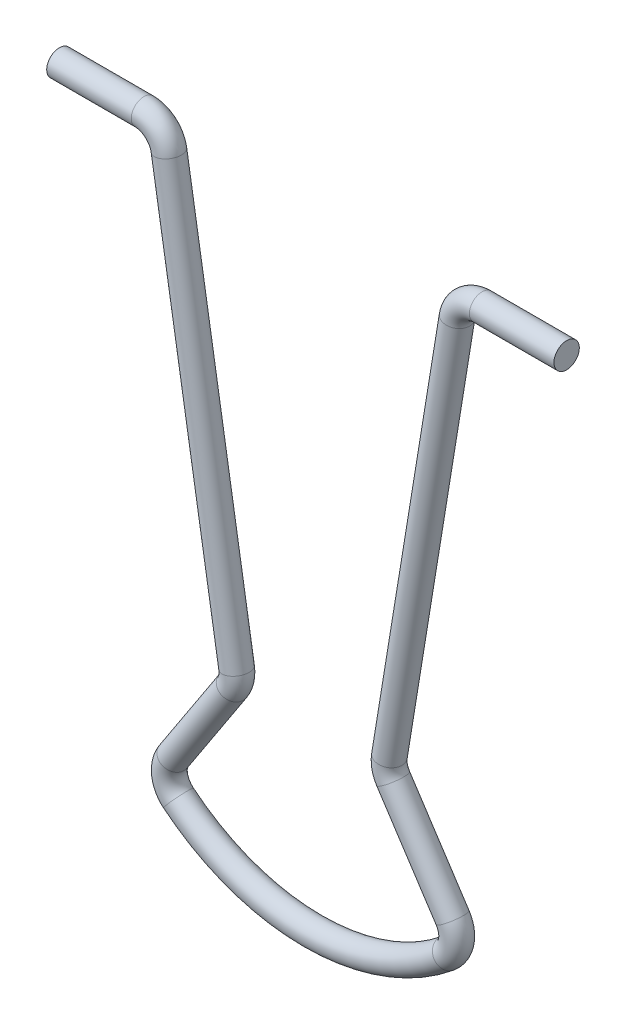
ISO-10303-21;
HEADER;
FILE_DESCRIPTION(('STEP AP214'),'2;1');
FILE_NAME('part.step','',(''),(''),'','','');
FILE_SCHEMA(('AUTOMOTIVE_DESIGN { 1 0 10303 214 1 1 1 1 }'));
ENDSEC;
DATA;
#1=APPLICATION_CONTEXT('core data for automotive mechanical design processes');
#2=APPLICATION_PROTOCOL_DEFINITION('international standard','automotive_design',2000,#1);
#3=PRODUCT_CONTEXT('',#1,'mechanical');
#4=PRODUCT('Part','Part','',(#3));
#5=PRODUCT_RELATED_PRODUCT_CATEGORY('part','',(#4));
#6=PRODUCT_DEFINITION_FORMATION('','',#4);
#7=PRODUCT_DEFINITION_CONTEXT('part definition',#1,'design');
#8=PRODUCT_DEFINITION('design','',#6,#7);
#9=PRODUCT_DEFINITION_SHAPE('','',#8);
#10=(LENGTH_UNIT() NAMED_UNIT(*) SI_UNIT(.MILLI.,.METRE.));
#11=(NAMED_UNIT(*) PLANE_ANGLE_UNIT() SI_UNIT($,.RADIAN.));
#12=(NAMED_UNIT(*) SI_UNIT($,.STERADIAN.) SOLID_ANGLE_UNIT());
#13=UNCERTAINTY_MEASURE_WITH_UNIT(LENGTH_MEASURE(1.E-05),#10,'distance_accuracy_value','');
#14=(GEOMETRIC_REPRESENTATION_CONTEXT(3) GLOBAL_UNCERTAINTY_ASSIGNED_CONTEXT((#13)) GLOBAL_UNIT_ASSIGNED_CONTEXT((#10,
#11,#12)) REPRESENTATION_CONTEXT('',''));
#15=CARTESIAN_POINT('',(0.,0.,0.));
#16=DIRECTION('',(0.,0.,1.));
#17=DIRECTION('',(1.,0.,0.));
#18=AXIS2_PLACEMENT_3D('',#15,#16,#17);
#19=CARTESIAN_POINT('',(-10.,37.,0.));
#20=DIRECTION('',(1.,0.,0.));
#21=DIRECTION('',(0.,0.,1.));
#22=AXIS2_PLACEMENT_3D('',#19,#20,#21);
#23=CYLINDRICAL_SURFACE('',#22,0.750000000000001);
#24=CARTESIAN_POINT('',(-15.,37.,0.));
#25=DIRECTION('',(-1.,0.,0.));
#26=DIRECTION('',(0.,1.,0.));
#27=AXIS2_PLACEMENT_3D('',#24,#25,#26);
#28=CIRCLE('',#27,0.750000000000001);
#29=CARTESIAN_POINT('',(-15.,37.75,0.));
#30=VERTEX_POINT('',#29);
#31=EDGE_CURVE('E29',#30,#30,#28,.T.);
#32=ORIENTED_EDGE('',*,*,#31,.F.);
#33=EDGE_LOOP('',(#32));
#34=FACE_BOUND('',#33,.T.);
#35=CARTESIAN_POINT('',(-10.,37.,0.));
#36=DIRECTION('',(-1.,0.,0.));
#37=DIRECTION('',(0.,1.,0.));
#38=AXIS2_PLACEMENT_3D('',#35,#36,#37);
#39=CIRCLE('',#38,0.750000000000001);
#40=CARTESIAN_POINT('',(-10.,37.75,0.));
#41=VERTEX_POINT('',#40);
#42=EDGE_CURVE('E8',#41,#41,#39,.T.);
#43=ORIENTED_EDGE('',*,*,#42,.T.);
#44=EDGE_LOOP('',(#43));
#45=FACE_BOUND('',#44,.T.);
#46=ADVANCED_FACE('F13',(#34,#45),#23,.T.);
#47=CARTESIAN_POINT('',(-10.,35.5,0.));
#48=DIRECTION('',(0.,0.,-1.));
#49=DIRECTION('',(0.,-1.,0.));
#50=AXIS2_PLACEMENT_3D('',#47,#48,#49);
#51=TOROIDAL_SURFACE('',#50,1.5,0.750000000000001);
#52=CARTESIAN_POINT('',(-8.51960067883648,35.7416978483532,0.));
#53=DIRECTION('',(-0.161131898902153,0.986932880775682,0.));
#54=DIRECTION('',(0.,0.,1.));
#55=AXIS2_PLACEMENT_3D('',#52,#53,#54);
#56=CIRCLE('',#55,0.750000000000001);
#57=CARTESIAN_POINT('',(-7.77940101825471,35.8625467725298,0.));
#58=VERTEX_POINT('',#57);
#59=EDGE_CURVE('E21',#58,#58,#56,.T.);
#60=CARTESIAN_POINT('',(-10.,35.5,0.));
#61=DIRECTION('',(0.,0.,-1.));
#62=DIRECTION('',(0.,-1.,0.));
#63=AXIS2_PLACEMENT_3D('',#60,#61,#62);
#64=CIRCLE('',#63,2.25);
#65=EDGE_CURVE('',#41,#58,#64,.T.);
#66=ORIENTED_EDGE('',*,*,#42,.F.);
#67=ORIENTED_EDGE('',*,*,#59,.T.);
#68=ORIENTED_EDGE('',*,*,#65,.T.);
#69=ORIENTED_EDGE('',*,*,#65,.F.);
#70=EDGE_LOOP('',(#66,#68,#67,#69));
#71=FACE_BOUND('',#70,.T.);
#72=ADVANCED_FACE('F80',(#71),#51,.T.);
#73=CARTESIAN_POINT('',(-4.51960067883648,11.2416978483532,0.));
#74=DIRECTION('',(0.161131898902152,-0.986932880775682,0.));
#75=DIRECTION('',(0.,0.,-1.));
#76=AXIS2_PLACEMENT_3D('',#73,#74,#75);
#77=CYLINDRICAL_SURFACE('',#76,0.750000000000001);
#78=ORIENTED_EDGE('',*,*,#59,.F.);
#79=EDGE_LOOP('',(#78));
#80=FACE_BOUND('',#79,.T.);
#81=CARTESIAN_POINT('',(-4.51960067883648,11.2416978483532,0.));
#82=DIRECTION('',(-0.161131898902153,0.986932880775682,0.));
#83=DIRECTION('',(0.,0.,1.));
#84=AXIS2_PLACEMENT_3D('',#81,#82,#83);
#85=CIRCLE('',#84,0.750000000000001);
#86=CARTESIAN_POINT('',(-3.77940101825472,11.3625467725298,0.));
#87=VERTEX_POINT('',#86);
#88=EDGE_CURVE('E26',#87,#87,#85,.T.);
#89=ORIENTED_EDGE('',*,*,#88,.T.);
#90=EDGE_LOOP('',(#89));
#91=FACE_BOUND('',#90,.T.);
#92=ADVANCED_FACE('F86',(#80,#91),#77,.T.);
#93=CARTESIAN_POINT('',(-6.,11.,0.));
#94=DIRECTION('',(0.,0.,-1.));
#95=DIRECTION('',(0.,-1.,0.));
#96=AXIS2_PLACEMENT_3D('',#93,#94,#95);
#97=TOROIDAL_SURFACE('',#96,1.5,0.750000000000001);
#98=CARTESIAN_POINT('',(-4.7453439101391,10.177906272877,0.));
#99=DIRECTION('',(0.548062484748657,0.836437393240599,0.));
#100=DIRECTION('',(0.,0.,-1.));
#101=AXIS2_PLACEMENT_3D('',#98,#99,#100);
#102=CIRCLE('',#101,0.750000000000001);
#103=CARTESIAN_POINT('',(-4.11801586520866,9.76685940931552,0.));
#104=VERTEX_POINT('',#103);
#105=EDGE_CURVE('E33',#104,#104,#102,.T.);
#106=CARTESIAN_POINT('',(-6.,11.,0.));
#107=DIRECTION('',(0.,0.,-1.));
#108=DIRECTION('',(0.,-1.,0.));
#109=AXIS2_PLACEMENT_3D('',#106,#107,#108);
#110=CIRCLE('',#109,2.25);
#111=EDGE_CURVE('',#87,#104,#110,.T.);
#112=ORIENTED_EDGE('',*,*,#88,.F.);
#113=ORIENTED_EDGE('',*,*,#105,.T.);
#114=ORIENTED_EDGE('',*,*,#111,.T.);
#115=ORIENTED_EDGE('',*,*,#111,.F.);
#116=EDGE_LOOP('',(#112,#114,#113,#115));
#117=FACE_BOUND('',#116,.T.);
#118=ADVANCED_FACE('F93',(#117),#97,.T.);
#119=CARTESIAN_POINT('',(-8.2546560898609,4.82209372712299,0.));
#120=DIRECTION('',(-0.548062484748657,-0.836437393240599,0.));
#121=DIRECTION('',(-0.836437393240599,0.548062484748657,0.));
#122=AXIS2_PLACEMENT_3D('',#119,#120,#121);
#123=CYLINDRICAL_SURFACE('',#122,0.750000000000001);
#124=ORIENTED_EDGE('',*,*,#105,.F.);
#125=EDGE_LOOP('',(#124));
#126=FACE_BOUND('',#125,.T.);
#127=CARTESIAN_POINT('',(-8.2546560898609,4.82209372712299,0.));
#128=DIRECTION('',(0.548062484748657,0.836437393240599,0.));
#129=DIRECTION('',(0.,0.,-1.));
#130=AXIS2_PLACEMENT_3D('',#127,#128,#129);
#131=CIRCLE('',#130,0.750000000000001);
#132=CARTESIAN_POINT('',(-8.88198413479135,5.23314059068448,0.));
#133=VERTEX_POINT('',#132);
#134=EDGE_CURVE('E36',#133,#133,#131,.T.);
#135=ORIENTED_EDGE('',*,*,#134,.T.);
#136=EDGE_LOOP('',(#135));
#137=FACE_BOUND('',#136,.T.);
#138=ADVANCED_FACE('F97',(#126,#137),#123,.T.);
#139=CARTESIAN_POINT('',(-7.,4.,0.));
#140=DIRECTION('',(0.,0.,1.));
#141=DIRECTION('',(1.,0.,0.));
#142=AXIS2_PLACEMENT_3D('',#139,#140,#141);
#143=TOROIDAL_SURFACE('',#142,1.5,0.75);
#144=CARTESIAN_POINT('',(-7.95022624434389,2.83936651583711,0.));
#145=DIRECTION('',(-0.773755656108598,0.633484162895927,0.));
#146=DIRECTION('',(0.,0.,1.));
#147=AXIS2_PLACEMENT_3D('',#144,#145,#146);
#148=CIRCLE('',#147,0.75);
#149=CARTESIAN_POINT('',(-8.42533936651584,2.25904977375566,0.));
#150=VERTEX_POINT('',#149);
#151=EDGE_CURVE('E39',#150,#150,#148,.T.);
#152=CARTESIAN_POINT('',(-7.,4.,0.));
#153=DIRECTION('',(0.,0.,1.));
#154=DIRECTION('',(1.,0.,0.));
#155=AXIS2_PLACEMENT_3D('',#152,#153,#154);
#156=CIRCLE('',#155,2.25);
#157=EDGE_CURVE('',#133,#150,#156,.T.);
#158=ORIENTED_EDGE('',*,*,#134,.F.);
#159=ORIENTED_EDGE('',*,*,#151,.T.);
#160=ORIENTED_EDGE('',*,*,#157,.T.);
#161=ORIENTED_EDGE('',*,*,#157,.F.);
#162=EDGE_LOOP('',(#158,#160,#159,#161));
#163=FACE_BOUND('',#162,.T.);
#164=ADVANCED_FACE('F101',(#163),#143,.T.);
#165=CARTESIAN_POINT('',(-15.,37.,0.));
#166=DIRECTION('',(1.,0.,0.));
#167=DIRECTION('',(0.,1.,0.));
#168=AXIS2_PLACEMENT_3D('',#165,#166,#167);
#169=PLANE('',#168);
#170=ORIENTED_EDGE('',*,*,#31,.T.);
#171=EDGE_LOOP('',(#170));
#172=FACE_BOUND('',#171,.T.);
#173=ADVANCED_FACE('F105',(#172),#169,.F.);
#174=CARTESIAN_POINT('',(10.,37.,0.));
#175=DIRECTION('',(1.,0.,0.));
#176=DIRECTION('',(0.,1.,0.));
#177=AXIS2_PLACEMENT_3D('',#174,#175,#176);
#178=CYLINDRICAL_SURFACE('',#177,0.750000000000001);
#179=CARTESIAN_POINT('',(15.,37.,0.));
#180=DIRECTION('',(-1.,0.,0.));
#181=DIRECTION('',(0.,0.,1.));
#182=AXIS2_PLACEMENT_3D('',#179,#180,#181);
#183=CIRCLE('',#182,0.750000000000001);
#184=CARTESIAN_POINT('',(15.,37.,0.750000000000001));
#185=VERTEX_POINT('',#184);
#186=EDGE_CURVE('E42',#185,#185,#183,.T.);
#187=ORIENTED_EDGE('',*,*,#186,.T.);
#188=EDGE_LOOP('',(#187));
#189=FACE_BOUND('',#188,.T.);
#190=CARTESIAN_POINT('',(10.,37.,0.));
#191=DIRECTION('',(-1.,0.,0.));
#192=DIRECTION('',(0.,0.,1.));
#193=AXIS2_PLACEMENT_3D('',#190,#191,#192);
#194=CIRCLE('',#193,0.750000000000001);
#195=CARTESIAN_POINT('',(10.,37.75,0.));
#196=VERTEX_POINT('',#195);
#197=EDGE_CURVE('E45',#196,#196,#194,.T.);
#198=ORIENTED_EDGE('',*,*,#197,.F.);
#199=EDGE_LOOP('',(#198));
#200=FACE_BOUND('',#199,.T.);
#201=ADVANCED_FACE('F110',(#189,#200),#178,.T.);
#202=CARTESIAN_POINT('',(10.,35.5,0.));
#203=DIRECTION('',(0.,0.,-1.));
#204=DIRECTION('',(0.,-1.,0.));
#205=AXIS2_PLACEMENT_3D('',#202,#203,#204);
#206=TOROIDAL_SURFACE('',#205,1.5,0.750000000000001);
#207=CARTESIAN_POINT('',(8.51960067883648,35.7416978483532,0.));
#208=DIRECTION('',(-0.161131898902153,-0.986932880775682,0.));
#209=DIRECTION('',(-0.986932880775682,0.161131898902153,0.));
#210=AXIS2_PLACEMENT_3D('',#207,#208,#209);
#211=CIRCLE('',#210,0.750000000000001);
#212=CARTESIAN_POINT('',(7.77940101825471,35.8625467725298,0.));
#213=VERTEX_POINT('',#212);
#214=EDGE_CURVE('E48',#213,#213,#211,.T.);
#215=CARTESIAN_POINT('',(10.,35.5,0.));
#216=DIRECTION('',(0.,0.,-1.));
#217=DIRECTION('',(0.,-1.,0.));
#218=AXIS2_PLACEMENT_3D('',#215,#216,#217);
#219=CIRCLE('',#218,2.25);
#220=EDGE_CURVE('',#213,#196,#219,.T.);
#221=ORIENTED_EDGE('',*,*,#214,.F.);
#222=ORIENTED_EDGE('',*,*,#197,.T.);
#223=ORIENTED_EDGE('',*,*,#220,.T.);
#224=ORIENTED_EDGE('',*,*,#220,.F.);
#225=EDGE_LOOP('',(#221,#223,#222,#224));
#226=FACE_BOUND('',#225,.T.);
#227=ADVANCED_FACE('F107',(#226),#206,.T.);
#228=CARTESIAN_POINT('',(4.51960067883648,11.2416978483532,0.));
#229=DIRECTION('',(0.161131898902152,0.986932880775682,0.));
#230=DIRECTION('',(0.,0.,-1.));
#231=AXIS2_PLACEMENT_3D('',#228,#229,#230);
#232=CYLINDRICAL_SURFACE('',#231,0.750000000000001);
#233=ORIENTED_EDGE('',*,*,#214,.T.);
#234=EDGE_LOOP('',(#233));
#235=FACE_BOUND('',#234,.T.);
#236=CARTESIAN_POINT('',(4.51960067883648,11.2416978483532,0.));
#237=DIRECTION('',(-0.161131898902153,-0.986932880775682,0.));
#238=DIRECTION('',(-0.986932880775682,0.161131898902153,0.));
#239=AXIS2_PLACEMENT_3D('',#236,#237,#238);
#240=CIRCLE('',#239,0.750000000000001);
#241=CARTESIAN_POINT('',(3.77940101825472,11.3625467725298,0.));
#242=VERTEX_POINT('',#241);
#243=EDGE_CURVE('E51',#242,#242,#240,.T.);
#244=ORIENTED_EDGE('',*,*,#243,.F.);
#245=EDGE_LOOP('',(#244));
#246=FACE_BOUND('',#245,.T.);
#247=ADVANCED_FACE('F109',(#235,#246),#232,.T.);
#248=CARTESIAN_POINT('',(6.,11.,0.));
#249=DIRECTION('',(0.,0.,-1.));
#250=DIRECTION('',(0.,-1.,0.));
#251=AXIS2_PLACEMENT_3D('',#248,#249,#250);
#252=TOROIDAL_SURFACE('',#251,1.5,0.750000000000001);
#253=CARTESIAN_POINT('',(4.7453439101391,10.177906272877,0.));
#254=DIRECTION('',(0.548062484748657,-0.836437393240599,0.));
#255=DIRECTION('',(0.,0.,-1.));
#256=AXIS2_PLACEMENT_3D('',#253,#254,#255);
#257=CIRCLE('',#256,0.750000000000001);
#258=CARTESIAN_POINT('',(4.11801586520866,9.76685940931552,0.));
#259=VERTEX_POINT('',#258);
#260=EDGE_CURVE('E54',#259,#259,#257,.T.);
#261=CARTESIAN_POINT('',(6.,11.,0.));
#262=DIRECTION('',(0.,0.,-1.));
#263=DIRECTION('',(0.,-1.,0.));
#264=AXIS2_PLACEMENT_3D('',#261,#262,#263);
#265=CIRCLE('',#264,2.25);
#266=EDGE_CURVE('',#259,#242,#265,.T.);
#267=ORIENTED_EDGE('',*,*,#260,.F.);
#268=ORIENTED_EDGE('',*,*,#243,.T.);
#269=ORIENTED_EDGE('',*,*,#266,.T.);
#270=ORIENTED_EDGE('',*,*,#266,.F.);
#271=EDGE_LOOP('',(#267,#269,#268,#270));
#272=FACE_BOUND('',#271,.T.);
#273=ADVANCED_FACE('F76',(#272),#252,.T.);
#274=CARTESIAN_POINT('',(8.2546560898609,4.82209372712299,0.));
#275=DIRECTION('',(-0.548062484748657,0.836437393240599,0.));
#276=DIRECTION('',(0.,0.,1.));
#277=AXIS2_PLACEMENT_3D('',#274,#275,#276);
#278=CYLINDRICAL_SURFACE('',#277,0.750000000000001);
#279=ORIENTED_EDGE('',*,*,#260,.T.);
#280=EDGE_LOOP('',(#279));
#281=FACE_BOUND('',#280,.T.);
#282=CARTESIAN_POINT('',(8.2546560898609,4.82209372712299,0.));
#283=DIRECTION('',(0.548062484748657,-0.836437393240599,0.));
#284=DIRECTION('',(0.,0.,-1.));
#285=AXIS2_PLACEMENT_3D('',#282,#283,#284);
#286=CIRCLE('',#285,0.750000000000001);
#287=CARTESIAN_POINT('',(8.88198413479135,5.23314059068448,0.));
#288=VERTEX_POINT('',#287);
#289=EDGE_CURVE('E56',#288,#288,#286,.T.);
#290=ORIENTED_EDGE('',*,*,#289,.F.);
#291=EDGE_LOOP('',(#290));
#292=FACE_BOUND('',#291,.T.);
#293=ADVANCED_FACE('F15',(#281,#292),#278,.T.);
#294=CARTESIAN_POINT('',(7.,4.,0.));
#295=DIRECTION('',(0.,0.,1.));
#296=DIRECTION('',(1.,0.,0.));
#297=AXIS2_PLACEMENT_3D('',#294,#295,#296);
#298=TOROIDAL_SURFACE('',#297,1.5,0.75);
#299=CARTESIAN_POINT('',(7.95022624434389,2.83936651583711,0.));
#300=DIRECTION('',(-0.773755656108598,-0.633484162895927,0.));
#301=DIRECTION('',(-0.633484162895927,0.773755656108598,0.));
#302=AXIS2_PLACEMENT_3D('',#299,#300,#301);
#303=CIRCLE('',#302,0.75);
#304=CARTESIAN_POINT('',(8.42533936651584,2.25904977375566,0.));
#305=VERTEX_POINT('',#304);
#306=EDGE_CURVE('E17',#305,#305,#303,.T.);
#307=CARTESIAN_POINT('',(7.,4.,0.));
#308=DIRECTION('',(0.,0.,1.));
#309=DIRECTION('',(1.,0.,0.));
#310=AXIS2_PLACEMENT_3D('',#307,#308,#309);
#311=CIRCLE('',#310,2.25);
#312=EDGE_CURVE('',#305,#288,#311,.T.);
#313=ORIENTED_EDGE('',*,*,#306,.F.);
#314=ORIENTED_EDGE('',*,*,#289,.T.);
#315=ORIENTED_EDGE('',*,*,#312,.T.);
#316=ORIENTED_EDGE('',*,*,#312,.F.);
#317=EDGE_LOOP('',(#313,#315,#314,#316));
#318=FACE_BOUND('',#317,.T.);
#319=ADVANCED_FACE('F65',(#318),#298,.T.);
#320=CARTESIAN_POINT('',(0.,12.55,0.));
#321=DIRECTION('',(0.,0.,1.));
#322=DIRECTION('',(1.,0.,0.));
#323=AXIS2_PLACEMENT_3D('',#320,#321,#322);
#324=TOROIDAL_SURFACE('',#323,12.55,0.75);
#325=CARTESIAN_POINT('',(0.,12.55,0.));
#326=DIRECTION('',(0.,0.,1.));
#327=DIRECTION('',(1.,0.,0.));
#328=AXIS2_PLACEMENT_3D('',#325,#326,#327);
#329=CIRCLE('',#328,13.3);
#330=EDGE_CURVE('',#150,#305,#329,.T.);
#331=ORIENTED_EDGE('',*,*,#151,.F.);
#332=ORIENTED_EDGE('',*,*,#306,.T.);
#333=ORIENTED_EDGE('',*,*,#330,.T.);
#334=ORIENTED_EDGE('',*,*,#330,.F.);
#335=EDGE_LOOP('',(#331,#333,#332,#334));
#336=FACE_BOUND('',#335,.T.);
#337=ADVANCED_FACE('F63',(#336),#324,.T.);
#338=CARTESIAN_POINT('',(15.,37.,0.));
#339=DIRECTION('',(-1.,0.,0.));
#340=DIRECTION('',(0.,-1.,0.));
#341=AXIS2_PLACEMENT_3D('',#338,#339,#340);
#342=PLANE('',#341);
#343=ORIENTED_EDGE('',*,*,#186,.F.);
#344=EDGE_LOOP('',(#343));
#345=FACE_BOUND('',#344,.T.);
#346=ADVANCED_FACE('F73',(#345),#342,.F.);
#347=CLOSED_SHELL('',(#46,#72,#92,#118,#138,#164,#173,#201,#227,#247,#273,#293,#319,#337,#346));
#348=MANIFOLD_SOLID_BREP('B1',#347);
#349=ADVANCED_BREP_SHAPE_REPRESENTATION('',(#18,#348),#14);
#350=SHAPE_DEFINITION_REPRESENTATION(#9,#349);
ENDSEC;
END-ISO-10303-21;
